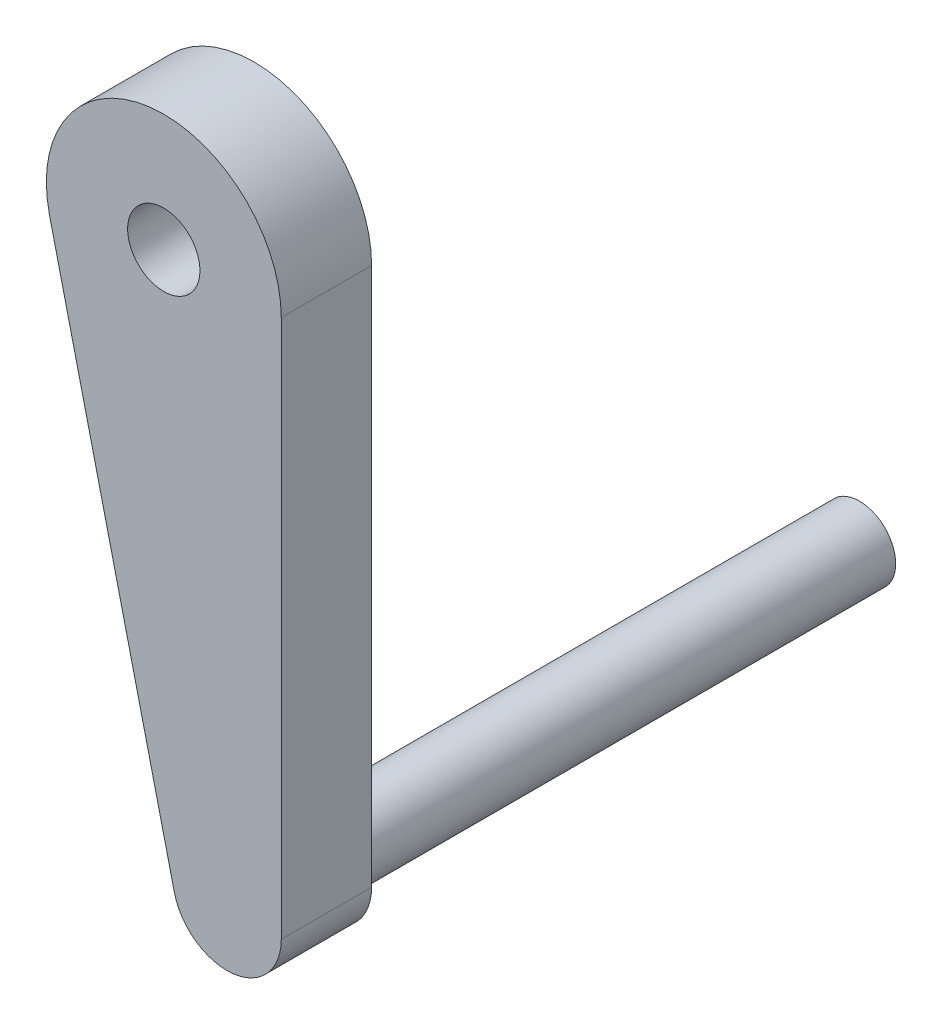
ISO-10303-21;
HEADER;
FILE_DESCRIPTION(('STEP AP214'),'2;1');
FILE_NAME('part.step','',(''),(''),'','','');
FILE_SCHEMA(('AUTOMOTIVE_DESIGN { 1 0 10303 214 1 1 1 1 }'));
ENDSEC;
DATA;
#1=APPLICATION_CONTEXT('core data for automotive mechanical design processes');
#2=APPLICATION_PROTOCOL_DEFINITION('international standard','automotive_design',2000,#1);
#3=PRODUCT_CONTEXT('',#1,'mechanical');
#4=PRODUCT('Part','Part','',(#3));
#5=PRODUCT_RELATED_PRODUCT_CATEGORY('part','',(#4));
#6=PRODUCT_DEFINITION_FORMATION('','',#4);
#7=PRODUCT_DEFINITION_CONTEXT('part definition',#1,'design');
#8=PRODUCT_DEFINITION('design','',#6,#7);
#9=PRODUCT_DEFINITION_SHAPE('','',#8);
#10=(LENGTH_UNIT() NAMED_UNIT(*) SI_UNIT(.MILLI.,.METRE.));
#11=(NAMED_UNIT(*) PLANE_ANGLE_UNIT() SI_UNIT($,.RADIAN.));
#12=(NAMED_UNIT(*) SI_UNIT($,.STERADIAN.) SOLID_ANGLE_UNIT());
#13=UNCERTAINTY_MEASURE_WITH_UNIT(LENGTH_MEASURE(1.E-05),#10,'distance_accuracy_value','');
#14=(GEOMETRIC_REPRESENTATION_CONTEXT(3) GLOBAL_UNCERTAINTY_ASSIGNED_CONTEXT((#13)) GLOBAL_UNIT_ASSIGNED_CONTEXT((#10,
#11,#12)) REPRESENTATION_CONTEXT('',''));
#15=CARTESIAN_POINT('',(0.,0.,0.));
#16=DIRECTION('',(0.,0.,1.));
#17=DIRECTION('',(1.,0.,0.));
#18=AXIS2_PLACEMENT_3D('',#15,#16,#17);
#19=CARTESIAN_POINT('',(0.,0.,6.35));
#20=DIRECTION('',(0.,0.,-1.));
#21=DIRECTION('',(-1.,0.,0.));
#22=AXIS2_PLACEMENT_3D('',#19,#20,#21);
#23=CYLINDRICAL_SURFACE('',#22,8.255);
#24=CARTESIAN_POINT('',(0.,0.,0.));
#25=DIRECTION('',(0.,0.,1.));
#26=DIRECTION('',(1.,0.,0.));
#27=AXIS2_PLACEMENT_3D('',#24,#25,#26);
#28=CIRCLE('',#27,8.255);
#29=CARTESIAN_POINT('',(8.255,0.,0.));
#30=VERTEX_POINT('',#29);
#31=CARTESIAN_POINT('',(-8.03028055555555,-1.91301312046373,0.));
#32=VERTEX_POINT('',#31);
#33=EDGE_CURVE('E100',#30,#32,#28,.T.);
#34=ORIENTED_EDGE('',*,*,#33,.T.);
#35=DIRECTION('',(0.,0.,-1.));
#36=VECTOR('',#35,1.);
#37=CARTESIAN_POINT('',(-8.03028055555555,-1.91301312046373,6.35));
#38=LINE('',#37,#36);
#39=CARTESIAN_POINT('',(-8.03028055555555,-1.91301312046373,6.35));
#40=VERTEX_POINT('',#39);
#41=EDGE_CURVE('E42',#40,#32,#38,.T.);
#42=ORIENTED_EDGE('',*,*,#41,.F.);
#43=CARTESIAN_POINT('',(0.,0.,6.35));
#44=DIRECTION('',(0.,0.,1.));
#45=DIRECTION('',(1.,0.,0.));
#46=AXIS2_PLACEMENT_3D('',#43,#44,#45);
#47=CIRCLE('',#46,8.255);
#48=CARTESIAN_POINT('',(8.255,0.,6.35));
#49=VERTEX_POINT('',#48);
#50=EDGE_CURVE('E86',#49,#40,#47,.T.);
#51=ORIENTED_EDGE('',*,*,#50,.F.);
#52=DIRECTION('',(0.,0.,-1.));
#53=VECTOR('',#52,1.);
#54=CARTESIAN_POINT('',(8.255,0.,6.35));
#55=LINE('',#54,#53);
#56=EDGE_CURVE('E96',#49,#30,#55,.T.);
#57=ORIENTED_EDGE('',*,*,#56,.T.);
#58=EDGE_LOOP('',(#34,#42,#51,#57));
#59=FACE_BOUND('',#58,.T.);
#60=ADVANCED_FACE('F33',(#59),#23,.T.);
#61=CARTESIAN_POINT('',(0.738716666666671,-38.7227490977383,6.35));
#62=DIRECTION('',(0.972777777777778,0.231739929795727,0.));
#63=DIRECTION('',(-0.231739929795727,0.972777777777778,0.));
#64=AXIS2_PLACEMENT_3D('',#61,#62,#63);
#65=PLANE('',#64);
#66=DIRECTION('',(0.231739929795727,-0.972777777777778,0.));
#67=VECTOR('',#66,1.);
#68=CARTESIAN_POINT('',(0.738716666666671,-38.7227490977383,0.));
#69=LINE('',#68,#67);
#70=CARTESIAN_POINT('',(0.738716666666671,-38.7227490977383,0.));
#71=VERTEX_POINT('',#70);
#72=EDGE_CURVE('E91',#32,#71,#69,.T.);
#73=ORIENTED_EDGE('',*,*,#72,.T.);
#74=DIRECTION('',(0.,0.,-1.));
#75=VECTOR('',#74,1.);
#76=CARTESIAN_POINT('',(0.738716666666671,-38.7227490977383,6.35));
#77=LINE('',#76,#75);
#78=CARTESIAN_POINT('',(0.738716666666671,-38.7227490977383,6.35));
#79=VERTEX_POINT('',#78);
#80=EDGE_CURVE('E89',#79,#71,#77,.T.);
#81=ORIENTED_EDGE('',*,*,#80,.F.);
#82=DIRECTION('',(0.231739929795727,-0.972777777777778,0.));
#83=VECTOR('',#82,1.);
#84=CARTESIAN_POINT('',(0.738716666666671,-38.7227490977383,6.35));
#85=LINE('',#84,#83);
#86=EDGE_CURVE('E81',#40,#79,#85,.T.);
#87=ORIENTED_EDGE('',*,*,#86,.F.);
#88=ORIENTED_EDGE('',*,*,#41,.T.);
#89=EDGE_LOOP('',(#73,#81,#87,#88));
#90=FACE_BOUND('',#89,.T.);
#91=ADVANCED_FACE('F90',(#90),#65,.F.);
#92=CARTESIAN_POINT('',(4.445,-37.8398199652165,6.35));
#93=DIRECTION('',(0.,0.,-1.));
#94=DIRECTION('',(-1.,0.,0.));
#95=AXIS2_PLACEMENT_3D('',#92,#93,#94);
#96=CYLINDRICAL_SURFACE('',#95,3.81);
#97=CARTESIAN_POINT('',(4.445,-37.8398199652165,0.));
#98=DIRECTION('',(0.,0.,1.));
#99=DIRECTION('',(1.,0.,0.));
#100=AXIS2_PLACEMENT_3D('',#97,#98,#99);
#101=CIRCLE('',#100,3.81);
#102=CARTESIAN_POINT('',(8.255,-37.8398199652165,0.));
#103=VERTEX_POINT('',#102);
#104=EDGE_CURVE('E67',#71,#103,#101,.T.);
#105=ORIENTED_EDGE('',*,*,#104,.T.);
#106=DIRECTION('',(0.,0.,-1.));
#107=VECTOR('',#106,1.);
#108=CARTESIAN_POINT('',(8.255,-37.8398199652165,6.35));
#109=LINE('',#108,#107);
#110=CARTESIAN_POINT('',(8.255,-37.8398199652165,6.35));
#111=VERTEX_POINT('',#110);
#112=EDGE_CURVE('E92',#111,#103,#109,.T.);
#113=ORIENTED_EDGE('',*,*,#112,.F.);
#114=CARTESIAN_POINT('',(4.445,-37.8398199652165,6.35));
#115=DIRECTION('',(0.,0.,1.));
#116=DIRECTION('',(1.,0.,0.));
#117=AXIS2_PLACEMENT_3D('',#114,#115,#116);
#118=CIRCLE('',#117,3.81);
#119=EDGE_CURVE('E84',#79,#111,#118,.T.);
#120=ORIENTED_EDGE('',*,*,#119,.F.);
#121=ORIENTED_EDGE('',*,*,#80,.T.);
#122=EDGE_LOOP('',(#105,#113,#120,#121));
#123=FACE_BOUND('',#122,.T.);
#124=ADVANCED_FACE('F94',(#123),#96,.T.);
#125=CARTESIAN_POINT('',(8.255,0.,6.35));
#126=DIRECTION('',(-1.,0.,0.));
#127=DIRECTION('',(0.,-1.,0.));
#128=AXIS2_PLACEMENT_3D('',#125,#126,#127);
#129=PLANE('',#128);
#130=DIRECTION('',(0.,1.,0.));
#131=VECTOR('',#130,1.);
#132=CARTESIAN_POINT('',(8.255,0.,0.));
#133=LINE('',#132,#131);
#134=EDGE_CURVE('E73',#103,#30,#133,.T.);
#135=ORIENTED_EDGE('',*,*,#134,.T.);
#136=ORIENTED_EDGE('',*,*,#56,.F.);
#137=DIRECTION('',(0.,1.,0.));
#138=VECTOR('',#137,1.);
#139=CARTESIAN_POINT('',(8.255,0.,6.35));
#140=LINE('',#139,#138);
#141=EDGE_CURVE('E50',#111,#49,#140,.T.);
#142=ORIENTED_EDGE('',*,*,#141,.F.);
#143=ORIENTED_EDGE('',*,*,#112,.T.);
#144=EDGE_LOOP('',(#135,#136,#142,#143));
#145=FACE_BOUND('',#144,.T.);
#146=ADVANCED_FACE('F124',(#145),#129,.F.);
#147=CARTESIAN_POINT('',(0.,0.,6.35));
#148=DIRECTION('',(0.,0.,1.));
#149=DIRECTION('',(1.,0.,0.));
#150=AXIS2_PLACEMENT_3D('',#147,#148,#149);
#151=PLANE('',#150);
#152=CARTESIAN_POINT('',(0.,0.,6.35));
#153=DIRECTION('',(0.,0.,1.));
#154=DIRECTION('',(1.,0.,0.));
#155=AXIS2_PLACEMENT_3D('',#152,#153,#154);
#156=CIRCLE('',#155,2.54);
#157=CARTESIAN_POINT('',(2.54,0.,6.35));
#158=VERTEX_POINT('',#157);
#159=EDGE_CURVE('E183',#158,#158,#156,.T.);
#160=ORIENTED_EDGE('',*,*,#159,.F.);
#161=EDGE_LOOP('',(#160));
#162=FACE_BOUND('',#161,.T.);
#163=ORIENTED_EDGE('',*,*,#50,.T.);
#164=ORIENTED_EDGE('',*,*,#86,.T.);
#165=ORIENTED_EDGE('',*,*,#119,.T.);
#166=ORIENTED_EDGE('',*,*,#141,.T.);
#167=EDGE_LOOP('',(#163,#164,#165,#166));
#168=FACE_BOUND('',#167,.T.);
#169=ADVANCED_FACE('F82',(#162,#168),#151,.T.);
#170=CARTESIAN_POINT('',(0.,0.,0.));
#171=DIRECTION('',(0.,0.,1.));
#172=DIRECTION('',(1.,0.,0.));
#173=AXIS2_PLACEMENT_3D('',#170,#171,#172);
#174=PLANE('',#173);
#175=CARTESIAN_POINT('',(0.,0.,0.));
#176=DIRECTION('',(0.,0.,1.));
#177=DIRECTION('',(1.,0.,0.));
#178=AXIS2_PLACEMENT_3D('',#175,#176,#177);
#179=CIRCLE('',#178,2.54);
#180=CARTESIAN_POINT('',(2.54,0.,0.));
#181=VERTEX_POINT('',#180);
#182=EDGE_CURVE('E36',#181,#181,#179,.T.);
#183=ORIENTED_EDGE('',*,*,#182,.T.);
#184=EDGE_LOOP('',(#183));
#185=FACE_BOUND('',#184,.T.);
#186=CARTESIAN_POINT('',(4.445,-37.8398199652165,0.));
#187=DIRECTION('',(0.,0.,1.));
#188=DIRECTION('',(1.,0.,0.));
#189=AXIS2_PLACEMENT_3D('',#186,#187,#188);
#190=CIRCLE('',#189,2.54);
#191=CARTESIAN_POINT('',(6.985,-37.8398199652165,0.));
#192=VERTEX_POINT('',#191);
#193=EDGE_CURVE('E11',#192,#192,#190,.F.);
#194=ORIENTED_EDGE('',*,*,#193,.F.);
#195=EDGE_LOOP('',(#194));
#196=FACE_BOUND('',#195,.T.);
#197=ORIENTED_EDGE('',*,*,#33,.F.);
#198=ORIENTED_EDGE('',*,*,#134,.F.);
#199=ORIENTED_EDGE('',*,*,#104,.F.);
#200=ORIENTED_EDGE('',*,*,#72,.F.);
#201=EDGE_LOOP('',(#197,#198,#199,#200));
#202=FACE_BOUND('',#201,.T.);
#203=ADVANCED_FACE('F112',(#185,#196,#202),#174,.F.);
#204=CARTESIAN_POINT('',(4.445,-37.8398199652165,-38.1));
#205=DIRECTION('',(0.,0.,1.));
#206=DIRECTION('',(1.,0.,0.));
#207=AXIS2_PLACEMENT_3D('',#204,#205,#206);
#208=CYLINDRICAL_SURFACE('',#207,2.54);
#209=CARTESIAN_POINT('',(4.445,-37.8398199652165,-38.1));
#210=DIRECTION('',(0.,0.,-1.));
#211=DIRECTION('',(-1.,0.,0.));
#212=AXIS2_PLACEMENT_3D('',#209,#210,#211);
#213=CIRCLE('',#212,2.54);
#214=CARTESIAN_POINT('',(1.905,-37.8398199652165,-38.1));
#215=VERTEX_POINT('',#214);
#216=EDGE_CURVE('E103',#215,#215,#213,.T.);
#217=ORIENTED_EDGE('',*,*,#216,.F.);
#218=EDGE_LOOP('',(#217));
#219=FACE_BOUND('',#218,.T.);
#220=ORIENTED_EDGE('',*,*,#193,.T.);
#221=EDGE_LOOP('',(#220));
#222=FACE_BOUND('',#221,.T.);
#223=ADVANCED_FACE('F114',(#219,#222),#208,.T.);
#224=CARTESIAN_POINT('',(4.445,-37.8398199652165,-38.1));
#225=DIRECTION('',(0.,0.,-1.));
#226=DIRECTION('',(-1.,0.,0.));
#227=AXIS2_PLACEMENT_3D('',#224,#225,#226);
#228=PLANE('',#227);
#229=ORIENTED_EDGE('',*,*,#216,.T.);
#230=EDGE_LOOP('',(#229));
#231=FACE_BOUND('',#230,.T.);
#232=ADVANCED_FACE('F121',(#231),#228,.T.);
#233=CARTESIAN_POINT('',(0.,0.,-31.75));
#234=DIRECTION('',(0.,0.,1.));
#235=DIRECTION('',(1.,0.,0.));
#236=AXIS2_PLACEMENT_3D('',#233,#234,#235);
#237=CYLINDRICAL_SURFACE('',#236,2.54);
#238=ORIENTED_EDGE('',*,*,#159,.T.);
#239=EDGE_LOOP('',(#238));
#240=FACE_BOUND('',#239,.T.);
#241=ORIENTED_EDGE('',*,*,#182,.F.);
#242=EDGE_LOOP('',(#241));
#243=FACE_BOUND('',#242,.T.);
#244=ADVANCED_FACE('F162',(#240,#243),#237,.F.);
#245=CLOSED_SHELL('',(#60,#91,#124,#146,#169,#203,#223,#232,#244));
#246=MANIFOLD_SOLID_BREP('B2',#245);
#247=ADVANCED_BREP_SHAPE_REPRESENTATION('',(#18,#246),#14);
#248=SHAPE_DEFINITION_REPRESENTATION(#9,#247);
ENDSEC;
END-ISO-10303-21;
